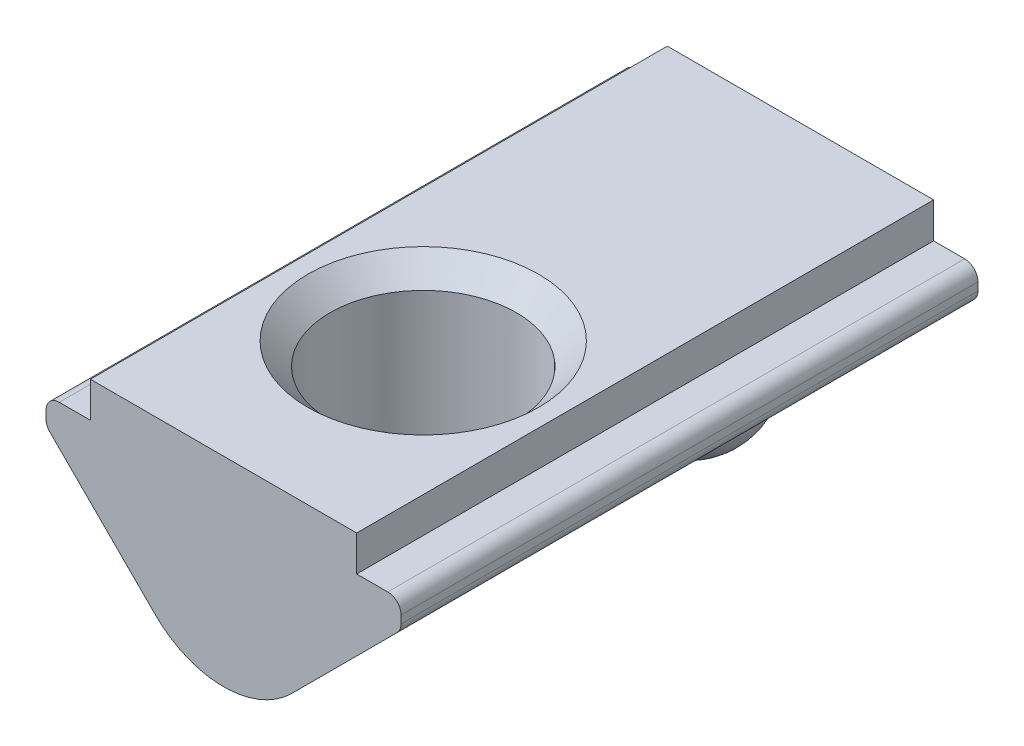
ISO-10303-21;
HEADER;
FILE_DESCRIPTION(('STEP AP214'),'2;1');
FILE_NAME('part.step','',(''),(''),'','','');
FILE_SCHEMA(('AUTOMOTIVE_DESIGN { 1 0 10303 214 1 1 1 1 }'));
ENDSEC;
DATA;
#1=APPLICATION_CONTEXT('core data for automotive mechanical design processes');
#2=APPLICATION_PROTOCOL_DEFINITION('international standard','automotive_design',2000,#1);
#3=PRODUCT_CONTEXT('',#1,'mechanical');
#4=PRODUCT('Part','Part','',(#3));
#5=PRODUCT_RELATED_PRODUCT_CATEGORY('part','',(#4));
#6=PRODUCT_DEFINITION_FORMATION('','',#4);
#7=PRODUCT_DEFINITION_CONTEXT('part definition',#1,'design');
#8=PRODUCT_DEFINITION('design','',#6,#7);
#9=PRODUCT_DEFINITION_SHAPE('','',#8);
#10=(LENGTH_UNIT() NAMED_UNIT(*) SI_UNIT(.MILLI.,.METRE.));
#11=(NAMED_UNIT(*) PLANE_ANGLE_UNIT() SI_UNIT($,.RADIAN.));
#12=(NAMED_UNIT(*) SI_UNIT($,.STERADIAN.) SOLID_ANGLE_UNIT());
#13=UNCERTAINTY_MEASURE_WITH_UNIT(LENGTH_MEASURE(1.E-05),#10,'distance_accuracy_value','');
#14=(GEOMETRIC_REPRESENTATION_CONTEXT(3) GLOBAL_UNCERTAINTY_ASSIGNED_CONTEXT((#13)) GLOBAL_UNIT_ASSIGNED_CONTEXT((#10,
#11,#12)) REPRESENTATION_CONTEXT('',''));
#15=CARTESIAN_POINT('',(0.,0.,0.));
#16=DIRECTION('',(0.,0.,1.));
#17=DIRECTION('',(1.,0.,0.));
#18=AXIS2_PLACEMENT_3D('',#15,#16,#17);
#19=CARTESIAN_POINT('',(0.,-2.3272077938642,6.5));
#20=DIRECTION('',(0.,0.,-1.));
#21=DIRECTION('',(-1.,0.,0.));
#22=AXIS2_PLACEMENT_3D('',#19,#20,#21);
#23=CYLINDRICAL_SURFACE('',#22,2.1727922061358);
#24=CARTESIAN_POINT('',(0.,-4.5,-2.8819660112501));
#25=CARTESIAN_POINT('',(0.0842303309173296,-4.49999855111517,-2.88196633157336));
#26=CARTESIAN_POINT('',(0.16847119543235,-4.49507118850862,-2.88710048706043));
#27=CARTESIAN_POINT('',(0.334563064093868,-4.47571560869941,-2.90768842694785));
#28=CARTESIAN_POINT('',(0.416414003630831,-4.4612871348904,-2.9231424900688));
#29=CARTESIAN_POINT('',(0.575407421912194,-4.42401419278143,-2.96452960837165));
#30=CARTESIAN_POINT('',(0.652550469946638,-4.40117074440119,-2.99046139365961));
#31=CARTESIAN_POINT('',(0.800002481194144,-4.34887590636583,-3.05315759958394));
#32=CARTESIAN_POINT('',(0.870305106224547,-4.31941847035847,-3.0899319419261));
#33=CARTESIAN_POINT('',(1.00116691911539,-4.25694776026208,-3.17436574832074));
#34=CARTESIAN_POINT('',(1.06181492041801,-4.22397220182363,-3.22191489589671));
#35=CARTESIAN_POINT('',(1.17182208721126,-4.15803908903499,-3.32863324249409));
#36=CARTESIAN_POINT('',(1.22121213180819,-4.12508173895149,-3.3877698084312));
#37=CARTESIAN_POINT('',(1.29003653326974,-4.07589491550365,-3.49318898289668));
#38=CARTESIAN_POINT('',(1.31374927827934,-4.05803780858356,-3.53593371820567));
#39=CARTESIAN_POINT('',(1.35494043677892,-4.0259840392101,-3.62562018448564));
#40=CARTESIAN_POINT('',(1.37242493804386,-4.01178380614159,-3.67255776072359));
#41=CARTESIAN_POINT('',(1.40045312716439,-3.98856233894596,-3.77025727943218));
#42=CARTESIAN_POINT('',(1.41092788072989,-3.97959264969888,-3.82105188720173));
#43=CARTESIAN_POINT('',(1.42394755705963,-3.96839017175623,-3.9243703584753));
#44=CARTESIAN_POINT('',(1.42650051336135,-3.96615055812741,-3.97689241548578));
#45=CARTESIAN_POINT('',(1.42372574834378,-3.96855713450931,-4.0739698188989));
#46=CARTESIAN_POINT('',(1.41947697116526,-3.97226077313887,-4.11858620613709));
#47=CARTESIAN_POINT('',(1.40528823238396,-3.98439729940903,-4.20623201513968));
#48=CARTESIAN_POINT('',(1.39534706719625,-3.99283118719448,-4.24926109923983));
#49=CARTESIAN_POINT('',(1.37018056785478,-4.01359286620544,-4.33294811804719));
#50=CARTESIAN_POINT('',(1.35493115899743,-4.02593837466991,-4.37359424675713));
#51=CARTESIAN_POINT('',(1.3197164608509,-4.05343910991889,-4.45175680581398));
#52=CARTESIAN_POINT('',(1.29974826616946,-4.0685960664918,-4.48927128864845));
#53=CARTESIAN_POINT('',(1.24459149962959,-4.10868998559647,-4.57882667993944));
#54=CARTESIAN_POINT('',(1.20678188896966,-4.13473099777314,-4.62876623852903));
#55=CARTESIAN_POINT('',(1.12328417546792,-4.18777619812761,-4.72096221660325));
#56=CARTESIAN_POINT('',(1.0775825044373,-4.21478198047074,-4.76320514251109));
#57=CARTESIAN_POINT('',(0.978753321303708,-4.26789532034229,-4.84089967514649));
#58=CARTESIAN_POINT('',(0.925509924549038,-4.29397891100982,-4.87621959826439));
#59=CARTESIAN_POINT('',(0.813471166476377,-4.34290433495116,-4.93942299137123));
#60=CARTESIAN_POINT('',(0.754677240720898,-4.36574700263737,-4.96730837709757));
#61=CARTESIAN_POINT('',(0.621943788707839,-4.41045739012713,-5.02019168950936));
#62=CARTESIAN_POINT('',(0.547158068491612,-4.43144882560476,-5.0438217054878));
#63=CARTESIAN_POINT('',(0.393446841529932,-4.46553276604001,-5.0814366908944));
#64=CARTESIAN_POINT('',(0.314519071093556,-4.47862090182166,-5.09541632591912));
#65=CARTESIAN_POINT('',(0.151400289992606,-4.49633087176125,-5.11422047718119));
#66=CARTESIAN_POINT('',(0.0671249533959798,-4.50059384801617,-5.11865721517349));
#67=CARTESIAN_POINT('',(-0.101254328687025,-4.4992721271511,-5.11727016892315));
#68=CARTESIAN_POINT('',(-0.185358284529483,-4.49368804386192,-5.11144702424526));
#69=CARTESIAN_POINT('',(-0.35113174844667,-4.4730682467818,-5.08947281741961));
#70=CARTESIAN_POINT('',(-0.432797988744982,-4.45802039460013,-5.07330849103682));
#71=CARTESIAN_POINT('',(-0.59130689253848,-4.41958274227056,-5.03045377036557));
#72=CARTESIAN_POINT('',(-0.668147475527518,-4.39618937272923,-5.00375887161402));
#73=CARTESIAN_POINT('',(-0.814718890163093,-4.34297972355502,-4.93953683249765));
#74=CARTESIAN_POINT('',(-0.884452670817997,-4.31316612415247,-4.90201421012796));
#75=CARTESIAN_POINT('',(-1.01464568029042,-4.24989748771758,-4.81561719161915));
#76=CARTESIAN_POINT('',(-1.07511394519103,-4.21644605359357,-4.76675397375317));
#77=CARTESIAN_POINT('',(-1.16928055316175,-4.15913814452597,-4.67234133882737));
#78=CARTESIAN_POINT('',(-1.20575807813653,-4.13518578907621,-4.6296105287969));
#79=CARTESIAN_POINT('',(-1.27154321895058,-4.08953541447432,-4.53788092869314));
#80=CARTESIAN_POINT('',(-1.30086271786266,-4.06783369397031,-4.48889273537551));
#81=CARTESIAN_POINT('',(-1.34593786475505,-4.03311484221702,-4.39570462054));
#82=CARTESIAN_POINT('',(-1.36324195092989,-4.01922938507074,-4.35258183902105));
#83=CARTESIAN_POINT('',(-1.39184227970683,-3.9957835846973,-4.26325869347268));
#84=CARTESIAN_POINT('',(-1.40314330241723,-3.98621980112478,-4.21706081116725));
#85=CARTESIAN_POINT('',(-1.4191946126179,-3.97251305993219,-4.12240949520959));
#86=CARTESIAN_POINT('',(-1.42390185058917,-3.96840573535232,-4.0739433542438));
#87=CARTESIAN_POINT('',(-1.42631627340881,-3.96630869989105,-3.97670811204484));
#88=CARTESIAN_POINT('',(-1.42402551773873,-3.96831718914949,-3.92793910415993));
#89=CARTESIAN_POINT('',(-1.41319292873848,-3.97764775845865,-3.83676111482451));
#90=CARTESIAN_POINT('',(-1.40531306689323,-3.98440650566728,-3.79421108606796));
#91=CARTESIAN_POINT('',(-1.38442633240564,-4.00189412926015,-3.71125363318761));
#92=CARTESIAN_POINT('',(-1.37141722395496,-4.01262473682984,-3.67084715214947));
#93=CARTESIAN_POINT('',(-1.33567747186543,-4.04117041666565,-3.57991300821325));
#94=CARTESIAN_POINT('',(-1.31115458891478,-4.06015479502001,-3.53045776082309));
#95=CARTESIAN_POINT('',(-1.25504465797441,-4.10121464460792,-3.4371457552608));
#96=CARTESIAN_POINT('',(-1.22344388269068,-4.12329609094912,-3.39330013994697));
#97=CARTESIAN_POINT('',(-1.14450321349988,-4.17488927914732,-3.29987057606816));
#98=CARTESIAN_POINT('',(-1.09523337930063,-4.20475155208763,-3.25211268447254));
#99=CARTESIAN_POINT('',(-0.988587325079709,-4.26303461411386,-3.16570684057961));
#100=CARTESIAN_POINT('',(-0.931206372423186,-4.29145454838024,-3.12706424220901));
#101=CARTESIAN_POINT('',(-0.8090743005586,-4.34486106466388,-3.05802658700122));
#102=CARTESIAN_POINT('',(-0.744235105523627,-4.36979681047844,-3.02774837988607));
#103=CARTESIAN_POINT('',(-0.609408359556503,-4.41399563728596,-2.9758213360058));
#104=CARTESIAN_POINT('',(-0.539421907015559,-4.4332599241669,-2.95417066447338));
#105=CARTESIAN_POINT('',(-0.392349601983774,-4.46567193528795,-2.91841938093128));
#106=CARTESIAN_POINT('',(-0.315083894665737,-4.47847295264263,-2.90474160136218));
#107=CARTESIAN_POINT('',(-0.158548954341807,-4.49563889887239,-2.88651343280822));
#108=CARTESIAN_POINT('',(-0.0792791429869385,-4.50000136371716,-2.88196570975594));
#109=CARTESIAN_POINT('',(0.,-4.5,-2.8819660112501));
#110=B_SPLINE_CURVE_WITH_KNOTS('',3,(#24,#25,#26,#27,#28,#29,#30,#31,#32,#33,#34,#35,#36,#37,
#38,#39,#40,#41,#42,#43,#44,#45,#46,#47,#48,#49,#50,#51,#52,#53,#54,#55,#56,#57,#58,#59,#60,#61,
#62,#63,#64,#65,#66,#67,#68,#69,#70,#71,#72,#73,#74,#75,#76,#77,#78,#79,#80,#81,#82,#83,#84,#85,
#86,#87,#88,#89,#90,#91,#92,#93,#94,#95,#96,#97,#98,#99,#100,#101,#102,#103,#104,#105,#106,#107,
#108,#109),.UNSPECIFIED.,.T.,.F.,(4,2,2,2,2,2,2,2,2,2,2,2,2,2,2,2,2,2,2,2,2,2,2,2,2,2,2,2,2,2,2,
2,2,2,2,2,2,2,2,2,2,2,4),(0.,0.252411735178092,0.504830287780983,0.757218256572261,
1.0098378987951,1.25997946392424,1.50942643822576,1.66499879554141,1.8204186692244,
1.97734533181334,2.1341128021284,2.26837014720749,2.40265588982667,2.53755877486978,
2.67254493805455,2.87494155135125,3.07768965770269,3.2839833704589,3.49022387379938,
3.73269674695461,3.97530354380059,4.22759586219719,4.4798724541404,4.7324732820823,
4.98518227765419,5.23778597952022,5.49014174289248,5.67272997324359,5.85501299481085,
5.99992791480923,6.14472726858611,6.29046765108396,6.43616514690186,6.56699003630751,
6.69787201466712,6.87204089572346,7.04655054134616,7.26987921484621,7.49333873707935,
7.71977802563765,7.9461691329506,8.18367437921688,8.42124896579195),.UNSPECIFIED.);
#111=CARTESIAN_POINT('',(0.,-4.5,-2.8819660112501));
#112=VERTEX_POINT('',#111);
#113=EDGE_CURVE('E244',#112,#112,#110,.T.);
#114=ORIENTED_EDGE('',*,*,#113,.T.);
#115=EDGE_LOOP('',(#114));
#116=FACE_BOUND('',#115,.T.);
#117=DIRECTION('',(0.,0.,-1.));
#118=VECTOR('',#117,1.);
#119=CARTESIAN_POINT('',(1.53639610306791,-3.8636038969321,6.5));
#120=LINE('',#119,#118);
#121=CARTESIAN_POINT('',(1.53639610306791,-3.8636038969321,0.568397047195788));
#122=VERTEX_POINT('',#121);
#123=CARTESIAN_POINT('',(1.53639610306791,-3.8636038969321,-6.5));
#124=VERTEX_POINT('',#123);
#125=EDGE_CURVE('E247',#122,#124,#120,.T.);
#126=ORIENTED_EDGE('',*,*,#125,.F.);
#127=CARTESIAN_POINT('',(1.53639610306791,-3.8636038969321,0.568397047195787));
#128=CARTESIAN_POINT('',(1.46613587375251,-3.9338978328833,0.493007522689332));
#129=CARTESIAN_POINT('',(1.38867800777796,-4.00165913458617,0.421017709796726));
#130=CARTESIAN_POINT('',(1.21874752388419,-4.12916793499698,0.286364229323557));
#131=CARTESIAN_POINT('',(1.12614193921448,-4.18883502492429,0.223793543991475));
#132=CARTESIAN_POINT('',(0.947688183957498,-4.28446917854302,0.123834006766832));
#133=CARTESIAN_POINT('',(0.864546403104193,-4.32278007847992,0.0839178546955437));
#134=CARTESIAN_POINT('',(0.690523750559167,-4.38945030034151,0.0145751321477001));
#135=CARTESIAN_POINT('',(0.599669325459111,-4.4178420478166,-0.0148856219484725));
#136=CARTESIAN_POINT('',(0.411090051250498,-4.46297506830245,-0.0616773894155721));
#137=CARTESIAN_POINT('',(0.313309780052928,-4.47960697832508,-0.0788945492679103));
#138=CARTESIAN_POINT('',(0.114883151271506,-4.49924553255216,-0.0992211525319119));
#139=CARTESIAN_POINT('',(0.0142368063091426,-4.50225223674934,-0.102330658060577));
#140=CARTESIAN_POINT('',(-0.172669817621513,-4.49487784371195,-0.0946998986578695));
#141=CARTESIAN_POINT('',(-0.259080978065078,-4.48620575452672,-0.0857276304671786));
#142=CARTESIAN_POINT('',(-0.428558416134259,-4.45904377900319,-0.0575985775867776));
#143=CARTESIAN_POINT('',(-0.511626398629306,-4.44055896674459,-0.0384470565000265));
#144=CARTESIAN_POINT('',(-0.673735919596493,-4.39464861560955,0.0091893279435033));
#145=CARTESIAN_POINT('',(-0.752704812076104,-4.36710153694084,0.0378010967101359));
#146=CARTESIAN_POINT('',(-0.904360335876589,-4.30455676826254,0.102906849641179));
#147=CARTESIAN_POINT('',(-0.977030956627136,-4.26954083058454,0.139420141781911));
#148=CARTESIAN_POINT('',(-1.14156741807881,-4.17915250884564,0.23394693381033));
#149=CARTESIAN_POINT('',(-1.23026535448202,-4.12109551667968,0.294863446922535));
#150=CARTESIAN_POINT('',(-1.39362635716822,-3.99732014053316,0.425625448503492));
#151=CARTESIAN_POINT('',(-1.4683771108253,-3.93165414456603,0.495410167759385));
#152=CARTESIAN_POINT('',(-1.53639610306791,-3.8636038969321,0.568397047195786));
#153=B_SPLINE_CURVE_WITH_KNOTS('',3,(#127,#128,#129,#130,#131,#132,#133,#134,#135,#136,#137,
#138,#139,#140,#141,#142,#143,#144,#145,#146,#147,#148,#149,#150,#151,#152),.UNSPECIFIED.,.F.,
.F.,(4,2,2,2,2,2,2,2,2,2,2,2,4),(0.,0.37487555133975,0.753238243125928,1.05165750379393,
1.34909190248225,1.64925721304226,1.94942120195184,2.21010159676562,2.47064732697058,
2.73484046982616,2.99968662919478,3.36494203369763,3.72781737385821),.UNSPECIFIED.);
#154=CARTESIAN_POINT('',(-1.53639610306791,-3.8636038969321,0.568397047195787));
#155=VERTEX_POINT('',#154);
#156=EDGE_CURVE('E161',#122,#155,#153,.T.);
#157=ORIENTED_EDGE('',*,*,#156,.T.);
#158=DIRECTION('',(0.,0.,-1.));
#159=VECTOR('',#158,1.);
#160=CARTESIAN_POINT('',(-1.53639610306791,-3.8636038969321,6.5));
#161=LINE('',#160,#159);
#162=CARTESIAN_POINT('',(-1.53639610306791,-3.8636038969321,-6.5));
#163=VERTEX_POINT('',#162);
#164=EDGE_CURVE('E171',#155,#163,#161,.T.);
#165=ORIENTED_EDGE('',*,*,#164,.T.);
#166=CARTESIAN_POINT('',(0.,-2.3272077938642,-6.5));
#167=DIRECTION('',(0.,0.,1.));
#168=DIRECTION('',(-1.,0.,0.));
#169=AXIS2_PLACEMENT_3D('',#166,#167,#168);
#170=CIRCLE('',#169,2.1727922061358);
#171=EDGE_CURVE('E249',#163,#124,#170,.T.);
#172=ORIENTED_EDGE('',*,*,#171,.T.);
#173=EDGE_LOOP('',(#126,#157,#165,#172));
#174=FACE_BOUND('',#173,.T.);
#175=ADVANCED_FACE('F37',(#116,#174),#23,.T.);
#176=CARTESIAN_POINT('',(3.,0.,6.5));
#177=DIRECTION('',(-1.,0.,0.));
#178=DIRECTION('',(0.,0.,1.));
#179=AXIS2_PLACEMENT_3D('',#176,#177,#178);
#180=PLANE('',#179);
#181=DIRECTION('',(0.,1.,0.));
#182=VECTOR('',#181,1.);
#183=CARTESIAN_POINT('',(3.,0.,-6.5));
#184=LINE('',#183,#182);
#185=CARTESIAN_POINT('',(3.,-0.8,-6.5));
#186=VERTEX_POINT('',#185);
#187=CARTESIAN_POINT('',(3.,0.,-6.5));
#188=VERTEX_POINT('',#187);
#189=EDGE_CURVE('E172',#186,#188,#184,.T.);
#190=ORIENTED_EDGE('',*,*,#189,.T.);
#191=DIRECTION('',(0.,0.,-1.));
#192=VECTOR('',#191,1.);
#193=CARTESIAN_POINT('',(3.,0.,6.5));
#194=LINE('',#193,#192);
#195=CARTESIAN_POINT('',(3.,0.,6.5));
#196=VERTEX_POINT('',#195);
#197=EDGE_CURVE('E162',#196,#188,#194,.T.);
#198=ORIENTED_EDGE('',*,*,#197,.F.);
#199=DIRECTION('',(0.,1.,0.));
#200=VECTOR('',#199,1.);
#201=CARTESIAN_POINT('',(3.,0.,6.5));
#202=LINE('',#201,#200);
#203=CARTESIAN_POINT('',(3.,-0.8,6.5));
#204=VERTEX_POINT('',#203);
#205=EDGE_CURVE('E263',#204,#196,#202,.T.);
#206=ORIENTED_EDGE('',*,*,#205,.F.);
#207=DIRECTION('',(0.,0.,-1.));
#208=VECTOR('',#207,1.);
#209=CARTESIAN_POINT('',(3.,-0.8,6.5));
#210=LINE('',#209,#208);
#211=EDGE_CURVE('E251',#204,#186,#210,.T.);
#212=ORIENTED_EDGE('',*,*,#211,.T.);
#213=EDGE_LOOP('',(#190,#198,#206,#212));
#214=FACE_BOUND('',#213,.T.);
#215=ADVANCED_FACE('F233',(#214),#180,.F.);
#216=CARTESIAN_POINT('',(-3.,0.,6.5));
#217=DIRECTION('',(0.,-1.,0.));
#218=DIRECTION('',(0.,0.,-1.));
#219=AXIS2_PLACEMENT_3D('',#216,#217,#218);
#220=PLANE('',#219);
#221=CARTESIAN_POINT('',(0.,0.,2.));
#222=DIRECTION('',(0.,1.,0.));
#223=DIRECTION('',(0.,0.,1.));
#224=AXIS2_PLACEMENT_3D('',#221,#222,#223);
#225=CIRCLE('',#224,2.6);
#226=CARTESIAN_POINT('',(0.,0.,4.6));
#227=VERTEX_POINT('',#226);
#228=EDGE_CURVE('E305',#227,#227,#225,.T.);
#229=ORIENTED_EDGE('',*,*,#228,.F.);
#230=EDGE_LOOP('',(#229));
#231=FACE_BOUND('',#230,.T.);
#232=DIRECTION('',(-1.,0.,0.));
#233=VECTOR('',#232,1.);
#234=CARTESIAN_POINT('',(-3.,0.,-6.5));
#235=LINE('',#234,#233);
#236=CARTESIAN_POINT('',(-3.,0.,-6.5));
#237=VERTEX_POINT('',#236);
#238=EDGE_CURVE('E280',#188,#237,#235,.T.);
#239=ORIENTED_EDGE('',*,*,#238,.T.);
#240=DIRECTION('',(0.,0.,-1.));
#241=VECTOR('',#240,1.);
#242=CARTESIAN_POINT('',(-3.,0.,6.5));
#243=LINE('',#242,#241);
#244=CARTESIAN_POINT('',(-3.,0.,6.5));
#245=VERTEX_POINT('',#244);
#246=EDGE_CURVE('E179',#245,#237,#243,.T.);
#247=ORIENTED_EDGE('',*,*,#246,.F.);
#248=DIRECTION('',(-1.,0.,0.));
#249=VECTOR('',#248,1.);
#250=CARTESIAN_POINT('',(-3.,0.,6.5));
#251=LINE('',#250,#249);
#252=EDGE_CURVE('E297',#196,#245,#251,.T.);
#253=ORIENTED_EDGE('',*,*,#252,.F.);
#254=ORIENTED_EDGE('',*,*,#197,.T.);
#255=EDGE_LOOP('',(#239,#247,#253,#254));
#256=FACE_BOUND('',#255,.T.);
#257=ADVANCED_FACE('F238',(#231,#256),#220,.F.);
#258=CARTESIAN_POINT('',(-3.,0.,6.5));
#259=DIRECTION('',(1.,0.,0.));
#260=DIRECTION('',(0.,0.,-1.));
#261=AXIS2_PLACEMENT_3D('',#258,#259,#260);
#262=PLANE('',#261);
#263=DIRECTION('',(0.,-1.,0.));
#264=VECTOR('',#263,1.);
#265=CARTESIAN_POINT('',(-3.,0.,-6.5));
#266=LINE('',#265,#264);
#267=CARTESIAN_POINT('',(-3.,-0.8,-6.5));
#268=VERTEX_POINT('',#267);
#269=EDGE_CURVE('E278',#237,#268,#266,.T.);
#270=ORIENTED_EDGE('',*,*,#269,.T.);
#271=DIRECTION('',(0.,0.,-1.));
#272=VECTOR('',#271,1.);
#273=CARTESIAN_POINT('',(-3.,-0.8,6.5));
#274=LINE('',#273,#272);
#275=CARTESIAN_POINT('',(-3.,-0.8,6.5));
#276=VERTEX_POINT('',#275);
#277=EDGE_CURVE('E176',#276,#268,#274,.T.);
#278=ORIENTED_EDGE('',*,*,#277,.F.);
#279=DIRECTION('',(0.,-1.,0.));
#280=VECTOR('',#279,1.);
#281=CARTESIAN_POINT('',(-3.,0.,6.5));
#282=LINE('',#281,#280);
#283=EDGE_CURVE('E295',#245,#276,#282,.T.);
#284=ORIENTED_EDGE('',*,*,#283,.F.);
#285=ORIENTED_EDGE('',*,*,#246,.T.);
#286=EDGE_LOOP('',(#270,#278,#284,#285));
#287=FACE_BOUND('',#286,.T.);
#288=ADVANCED_FACE('F383',(#287),#262,.F.);
#289=CARTESIAN_POINT('',(-3.,-0.8,6.5));
#290=DIRECTION('',(0.,-1.,0.));
#291=DIRECTION('',(1.,0.,0.));
#292=AXIS2_PLACEMENT_3D('',#289,#290,#291);
#293=PLANE('',#292);
#294=DIRECTION('',(-1.,0.,0.));
#295=VECTOR('',#294,1.);
#296=CARTESIAN_POINT('',(-3.,-0.8,-6.5));
#297=LINE('',#296,#295);
#298=CARTESIAN_POINT('',(-3.7,-0.8,-6.5));
#299=VERTEX_POINT('',#298);
#300=EDGE_CURVE('E275',#268,#299,#297,.T.);
#301=ORIENTED_EDGE('',*,*,#300,.T.);
#302=DIRECTION('',(0.,0.,-1.));
#303=VECTOR('',#302,1.);
#304=CARTESIAN_POINT('',(-3.7,-0.8,6.5));
#305=LINE('',#304,#303);
#306=CARTESIAN_POINT('',(-3.7,-0.8,6.5));
#307=VERTEX_POINT('',#306);
#308=EDGE_CURVE('E45',#299,#307,#305,.F.);
#309=ORIENTED_EDGE('',*,*,#308,.T.);
#310=DIRECTION('',(-1.,0.,0.));
#311=VECTOR('',#310,1.);
#312=CARTESIAN_POINT('',(-3.,-0.8,6.5));
#313=LINE('',#312,#311);
#314=EDGE_CURVE('E292',#276,#307,#313,.T.);
#315=ORIENTED_EDGE('',*,*,#314,.F.);
#316=ORIENTED_EDGE('',*,*,#277,.T.);
#317=EDGE_LOOP('',(#301,#309,#315,#316));
#318=FACE_BOUND('',#317,.T.);
#319=ADVANCED_FACE('F374',(#318),#293,.F.);
#320=CARTESIAN_POINT('',(-4.,-0.8,6.5));
#321=DIRECTION('',(1.,0.,0.));
#322=DIRECTION('',(0.,0.,-1.));
#323=AXIS2_PLACEMENT_3D('',#320,#321,#322);
#324=PLANE('',#323);
#325=DIRECTION('',(0.,-1.,0.));
#326=VECTOR('',#325,1.);
#327=CARTESIAN_POINT('',(-4.,-0.8,6.5));
#328=LINE('',#327,#326);
#329=CARTESIAN_POINT('',(-4.,-1.1,6.5));
#330=VERTEX_POINT('',#329);
#331=CARTESIAN_POINT('',(-4.,-1.27573593128807,6.5));
#332=VERTEX_POINT('',#331);
#333=EDGE_CURVE('E290',#330,#332,#328,.T.);
#334=ORIENTED_EDGE('',*,*,#333,.F.);
#335=DIRECTION('',(0.,0.,-1.));
#336=VECTOR('',#335,1.);
#337=CARTESIAN_POINT('',(-4.,-1.1,6.5));
#338=LINE('',#337,#336);
#339=CARTESIAN_POINT('',(-4.,-1.1,-6.5));
#340=VERTEX_POINT('',#339);
#341=EDGE_CURVE('E450',#330,#340,#338,.T.);
#342=ORIENTED_EDGE('',*,*,#341,.T.);
#343=DIRECTION('',(0.,-1.,0.));
#344=VECTOR('',#343,1.);
#345=CARTESIAN_POINT('',(-4.,-0.8,-6.5));
#346=LINE('',#345,#344);
#347=CARTESIAN_POINT('',(-4.,-1.27573593128807,-6.5));
#348=VERTEX_POINT('',#347);
#349=EDGE_CURVE('E272',#340,#348,#346,.T.);
#350=ORIENTED_EDGE('',*,*,#349,.T.);
#351=DIRECTION('',(0.,0.,-1.));
#352=VECTOR('',#351,1.);
#353=CARTESIAN_POINT('',(-4.,-1.27573593128807,6.5));
#354=LINE('',#353,#352);
#355=EDGE_CURVE('E463',#348,#332,#354,.F.);
#356=ORIENTED_EDGE('',*,*,#355,.T.);
#357=EDGE_LOOP('',(#334,#342,#350,#356));
#358=FACE_BOUND('',#357,.T.);
#359=ADVANCED_FACE('F366',(#358),#324,.F.);
#360=CARTESIAN_POINT('',(-1.53639610306791,-3.8636038969321,6.5));
#361=DIRECTION('',(0.707106781186548,0.707106781186547,0.));
#362=DIRECTION('',(-0.707106781186547,0.707106781186548,0.));
#363=AXIS2_PLACEMENT_3D('',#360,#361,#362);
#364=PLANE('',#363);
#365=DIRECTION('',(0.707106781186547,-0.707106781186548,0.));
#366=VECTOR('',#365,1.);
#367=CARTESIAN_POINT('',(-1.53639610306791,-3.8636038969321,6.5));
#368=LINE('',#367,#366);
#369=CARTESIAN_POINT('',(-3.91213203435596,-1.48786796564404,6.5));
#370=VERTEX_POINT('',#369);
#371=CARTESIAN_POINT('',(-1.53639610306791,-3.8636038969321,6.5));
#372=VERTEX_POINT('',#371);
#373=EDGE_CURVE('E288',#370,#372,#368,.T.);
#374=ORIENTED_EDGE('',*,*,#373,.F.);
#375=DIRECTION('',(0.,0.,-1.));
#376=VECTOR('',#375,1.);
#377=CARTESIAN_POINT('',(-3.91213203435596,-1.48786796564404,6.5));
#378=LINE('',#377,#376);
#379=CARTESIAN_POINT('',(-3.91213203435596,-1.48786796564404,-6.5));
#380=VERTEX_POINT('',#379);
#381=EDGE_CURVE('E11',#370,#380,#378,.T.);
#382=ORIENTED_EDGE('',*,*,#381,.T.);
#383=DIRECTION('',(0.707106781186547,-0.707106781186548,0.));
#384=VECTOR('',#383,1.);
#385=CARTESIAN_POINT('',(-1.53639610306791,-3.8636038969321,-6.5));
#386=LINE('',#385,#384);
#387=EDGE_CURVE('E270',#380,#163,#386,.T.);
#388=ORIENTED_EDGE('',*,*,#387,.T.);
#389=ORIENTED_EDGE('',*,*,#164,.F.);
#390=CARTESIAN_POINT('',(0.,-5.40000000000001,2.));
#391=DIRECTION('',(0.707106781186548,0.707106781186547,0.));
#392=DIRECTION('',(-0.707106781186547,0.707106781186548,0.));
#393=AXIS2_PLACEMENT_3D('',#390,#391,#392);
#394=ELLIPSE('',#393,2.9698484809835,2.1);
#395=CARTESIAN_POINT('',(-1.53639610306791,-3.8636038969321,3.43160295280422));
#396=VERTEX_POINT('',#395);
#397=EDGE_CURVE('E153',#155,#396,#394,.T.);
#398=ORIENTED_EDGE('',*,*,#397,.T.);
#399=EDGE_CURVE('E168',#372,#396,#161,.T.);
#400=ORIENTED_EDGE('',*,*,#399,.F.);
#401=EDGE_LOOP('',(#374,#382,#388,#389,#398,#400));
#402=FACE_BOUND('',#401,.T.);
#403=ADVANCED_FACE('F167',(#402),#364,.F.);
#404=ORIENTED_EDGE('',*,*,#399,.T.);
#405=CARTESIAN_POINT('',(-1.53639610306791,-3.8636038969321,3.43160295280422));
#406=CARTESIAN_POINT('',(-1.46615001369697,-3.93388579631887,3.50697956872249));
#407=CARTESIAN_POINT('',(-1.38870534468911,-4.00163613975528,3.57895786409693));
#408=CARTESIAN_POINT('',(-1.21877742628574,-4.1291479996101,3.71361487481121));
#409=CARTESIAN_POINT('',(-1.12615638240135,-4.18882619435878,3.77619723791848));
#410=CARTESIAN_POINT('',(-0.947663459049502,-4.28448328888605,3.87618073240285));
#411=CARTESIAN_POINT('',(-0.864496075969729,-4.32280557660245,3.91610868335927));
#412=CARTESIAN_POINT('',(-0.69045637267669,-4.38946992297878,3.98544525801234));
#413=CARTESIAN_POINT('',(-0.599615969536779,-4.41785101960396,4.01489503569981));
#414=CARTESIAN_POINT('',(-0.424618326690317,-4.45974060885315,4.05832395866861));
#415=CARTESIAN_POINT('',(-0.341204831537578,-4.47473576188984,4.0738508543038));
#416=CARTESIAN_POINT('',(-0.171867299742489,-4.49486937784194,4.09469289450895));
#417=CARTESIAN_POINT('',(-0.0859419701245585,-4.50000267028731,4.1000026823588));
#418=CARTESIAN_POINT('',(0.0949556963847467,-4.49999704964884,4.09999703631127));
#419=CARTESIAN_POINT('',(0.18993170688794,-4.49372430489658,4.09350880438678));
#420=CARTESIAN_POINT('',(0.376550007661134,-4.46919477650357,4.06811329166899));
#421=CARTESIAN_POINT('',(0.468192301837336,-4.45093800690531,4.04920602542789));
#422=CARTESIAN_POINT('',(0.644937920061929,-4.40407816506341,4.00060154739426));
#423=CARTESIAN_POINT('',(0.730083783129199,-4.37555095813503,3.9709834470364));
#424=CARTESIAN_POINT('',(0.893264464767707,-4.30985017382978,3.90261185429579));
#425=CARTESIAN_POINT('',(0.971279228962007,-4.27265319702835,3.86383363516638));
#426=CARTESIAN_POINT('',(1.14091272932417,-4.17957275152246,3.76649402345834));
#427=CARTESIAN_POINT('',(1.22983325670392,-4.12140617897452,3.70546401828784));
#428=CARTESIAN_POINT('',(1.39347632786529,-3.99745038034009,3.57451280360195));
#429=CARTESIAN_POINT('',(1.46830355394868,-3.93172371594665,3.50466415787785));
#430=CARTESIAN_POINT('',(1.53639610306791,-3.8636038969321,3.43160295280421));
#431=B_SPLINE_CURVE_WITH_KNOTS('',3,(#405,#406,#407,#408,#409,#410,#411,#412,#413,#414,#415,
#416,#417,#418,#419,#420,#421,#422,#423,#424,#425,#426,#427,#428,#429,#430),.UNSPECIFIED.,.F.,
.F.,(4,2,2,2,2,2,2,2,2,2,2,2,4),(0.,0.374812235068192,0.753238199003681,1.05175793091317,
1.34909190857538,1.60644611826587,1.8639352192855,2.14843017400163,2.43292479535692,
2.71535964594455,2.99856579128375,3.36463377494207,3.72786505388237),.UNSPECIFIED.);
#432=CARTESIAN_POINT('',(1.53639610306791,-3.8636038969321,3.43160295280422));
#433=VERTEX_POINT('',#432);
#434=EDGE_CURVE('E150',#396,#433,#431,.T.);
#435=ORIENTED_EDGE('',*,*,#434,.T.);
#436=CARTESIAN_POINT('',(1.53639610306791,-3.8636038969321,6.5));
#437=VERTEX_POINT('',#436);
#438=EDGE_CURVE('E181',#437,#433,#120,.T.);
#439=ORIENTED_EDGE('',*,*,#438,.F.);
#440=CARTESIAN_POINT('',(0.,-2.3272077938642,6.5));
#441=DIRECTION('',(0.,0.,1.));
#442=DIRECTION('',(-1.,0.,0.));
#443=AXIS2_PLACEMENT_3D('',#440,#441,#442);
#444=CIRCLE('',#443,2.1727922061358);
#445=EDGE_CURVE('E175',#372,#437,#444,.T.);
#446=ORIENTED_EDGE('',*,*,#445,.F.);
#447=EDGE_LOOP('',(#404,#435,#439,#446));
#448=FACE_BOUND('',#447,.T.);
#449=ADVANCED_FACE('F174',(#448),#23,.T.);
#450=CARTESIAN_POINT('',(4.,-1.4,6.5));
#451=DIRECTION('',(-0.707106781186548,0.707106781186547,0.));
#452=DIRECTION('',(-0.707106781186547,-0.707106781186548,0.));
#453=AXIS2_PLACEMENT_3D('',#450,#451,#452);
#454=PLANE('',#453);
#455=DIRECTION('',(0.707106781186547,0.707106781186548,0.));
#456=VECTOR('',#455,1.);
#457=CARTESIAN_POINT('',(4.,-1.4,-6.5));
#458=LINE('',#457,#456);
#459=CARTESIAN_POINT('',(3.91213203435596,-1.48786796564404,-6.5));
#460=VERTEX_POINT('',#459);
#461=EDGE_CURVE('E267',#124,#460,#458,.T.);
#462=ORIENTED_EDGE('',*,*,#461,.T.);
#463=DIRECTION('',(0.,0.,-1.));
#464=VECTOR('',#463,1.);
#465=CARTESIAN_POINT('',(3.91213203435596,-1.48786796564404,6.5));
#466=LINE('',#465,#464);
#467=CARTESIAN_POINT('',(3.91213203435596,-1.48786796564404,6.5));
#468=VERTEX_POINT('',#467);
#469=EDGE_CURVE('E455',#460,#468,#466,.F.);
#470=ORIENTED_EDGE('',*,*,#469,.T.);
#471=DIRECTION('',(0.707106781186547,0.707106781186548,0.));
#472=VECTOR('',#471,1.);
#473=CARTESIAN_POINT('',(4.,-1.4,6.5));
#474=LINE('',#473,#472);
#475=EDGE_CURVE('E284',#437,#468,#474,.T.);
#476=ORIENTED_EDGE('',*,*,#475,.F.);
#477=ORIENTED_EDGE('',*,*,#438,.T.);
#478=CARTESIAN_POINT('',(0.,-5.40000000000001,2.));
#479=DIRECTION('',(-0.707106781186548,0.707106781186547,0.));
#480=DIRECTION('',(0.707106781186547,0.707106781186548,0.));
#481=AXIS2_PLACEMENT_3D('',#478,#479,#480);
#482=ELLIPSE('',#481,2.9698484809835,2.1);
#483=EDGE_CURVE('E156',#433,#122,#482,.T.);
#484=ORIENTED_EDGE('',*,*,#483,.T.);
#485=ORIENTED_EDGE('',*,*,#125,.T.);
#486=EDGE_LOOP('',(#462,#470,#476,#477,#484,#485));
#487=FACE_BOUND('',#486,.T.);
#488=ADVANCED_FACE('F224',(#487),#454,.F.);
#489=CARTESIAN_POINT('',(4.,-0.8,6.5));
#490=DIRECTION('',(-1.,0.,0.));
#491=DIRECTION('',(0.,0.,1.));
#492=AXIS2_PLACEMENT_3D('',#489,#490,#491);
#493=PLANE('',#492);
#494=DIRECTION('',(0.,1.,0.));
#495=VECTOR('',#494,1.);
#496=CARTESIAN_POINT('',(4.,-0.8,6.5));
#497=LINE('',#496,#495);
#498=CARTESIAN_POINT('',(4.,-1.27573593128807,6.5));
#499=VERTEX_POINT('',#498);
#500=CARTESIAN_POINT('',(4.,-1.1,6.5));
#501=VERTEX_POINT('',#500);
#502=EDGE_CURVE('E258',#499,#501,#497,.T.);
#503=ORIENTED_EDGE('',*,*,#502,.F.);
#504=DIRECTION('',(0.,0.,-1.));
#505=VECTOR('',#504,1.);
#506=CARTESIAN_POINT('',(4.,-1.27573593128807,6.5));
#507=LINE('',#506,#505);
#508=CARTESIAN_POINT('',(4.,-1.27573593128807,-6.5));
#509=VERTEX_POINT('',#508);
#510=EDGE_CURVE('E479',#499,#509,#507,.T.);
#511=ORIENTED_EDGE('',*,*,#510,.T.);
#512=DIRECTION('',(0.,1.,0.));
#513=VECTOR('',#512,1.);
#514=CARTESIAN_POINT('',(4.,-0.8,-6.5));
#515=LINE('',#514,#513);
#516=CARTESIAN_POINT('',(4.,-1.1,-6.5));
#517=VERTEX_POINT('',#516);
#518=EDGE_CURVE('E264',#509,#517,#515,.T.);
#519=ORIENTED_EDGE('',*,*,#518,.T.);
#520=DIRECTION('',(0.,0.,-1.));
#521=VECTOR('',#520,1.);
#522=CARTESIAN_POINT('',(4.,-1.1,6.5));
#523=LINE('',#522,#521);
#524=EDGE_CURVE('E313',#517,#501,#523,.F.);
#525=ORIENTED_EDGE('',*,*,#524,.T.);
#526=EDGE_LOOP('',(#503,#511,#519,#525));
#527=FACE_BOUND('',#526,.T.);
#528=ADVANCED_FACE('F221',(#527),#493,.F.);
#529=CARTESIAN_POINT('',(3.,-0.8,6.5));
#530=DIRECTION('',(0.,-1.,0.));
#531=DIRECTION('',(1.,0.,0.));
#532=AXIS2_PLACEMENT_3D('',#529,#530,#531);
#533=PLANE('',#532);
#534=DIRECTION('',(-1.,0.,0.));
#535=VECTOR('',#534,1.);
#536=CARTESIAN_POINT('',(3.,-0.8,6.5));
#537=LINE('',#536,#535);
#538=CARTESIAN_POINT('',(3.7,-0.8,6.5));
#539=VERTEX_POINT('',#538);
#540=EDGE_CURVE('E253',#539,#204,#537,.T.);
#541=ORIENTED_EDGE('',*,*,#540,.F.);
#542=DIRECTION('',(0.,0.,-1.));
#543=VECTOR('',#542,1.);
#544=CARTESIAN_POINT('',(3.7,-0.8,6.5));
#545=LINE('',#544,#543);
#546=CARTESIAN_POINT('',(3.7,-0.8,-6.5));
#547=VERTEX_POINT('',#546);
#548=EDGE_CURVE('E460',#539,#547,#545,.T.);
#549=ORIENTED_EDGE('',*,*,#548,.T.);
#550=DIRECTION('',(-1.,0.,0.));
#551=VECTOR('',#550,1.);
#552=CARTESIAN_POINT('',(3.,-0.8,-6.5));
#553=LINE('',#552,#551);
#554=EDGE_CURVE('E261',#547,#186,#553,.T.);
#555=ORIENTED_EDGE('',*,*,#554,.T.);
#556=ORIENTED_EDGE('',*,*,#211,.F.);
#557=EDGE_LOOP('',(#541,#549,#555,#556));
#558=FACE_BOUND('',#557,.T.);
#559=ADVANCED_FACE('F215',(#558),#533,.F.);
#560=CARTESIAN_POINT('',(0.,-2.3272077938642,6.5));
#561=DIRECTION('',(0.,0.,-1.));
#562=DIRECTION('',(-1.,0.,0.));
#563=AXIS2_PLACEMENT_3D('',#560,#561,#562);
#564=PLANE('',#563);
#565=ORIENTED_EDGE('',*,*,#475,.T.);
#566=CARTESIAN_POINT('',(3.7,-1.27573593128807,6.5));
#567=DIRECTION('',(0.,0.,-1.));
#568=DIRECTION('',(-1.,0.,0.));
#569=AXIS2_PLACEMENT_3D('',#566,#567,#568);
#570=CIRCLE('',#569,0.3);
#571=EDGE_CURVE('E453',#468,#499,#570,.F.);
#572=ORIENTED_EDGE('',*,*,#571,.T.);
#573=ORIENTED_EDGE('',*,*,#502,.T.);
#574=CARTESIAN_POINT('',(3.7,-1.1,6.5));
#575=DIRECTION('',(0.,0.,-1.));
#576=DIRECTION('',(-1.,0.,0.));
#577=AXIS2_PLACEMENT_3D('',#574,#575,#576);
#578=CIRCLE('',#577,0.3);
#579=EDGE_CURVE('E52',#501,#539,#578,.F.);
#580=ORIENTED_EDGE('',*,*,#579,.T.);
#581=ORIENTED_EDGE('',*,*,#540,.T.);
#582=ORIENTED_EDGE('',*,*,#205,.T.);
#583=ORIENTED_EDGE('',*,*,#252,.T.);
#584=ORIENTED_EDGE('',*,*,#283,.T.);
#585=ORIENTED_EDGE('',*,*,#314,.T.);
#586=CARTESIAN_POINT('',(-3.7,-1.1,6.5));
#587=DIRECTION('',(0.,0.,-1.));
#588=DIRECTION('',(-1.,0.,0.));
#589=AXIS2_PLACEMENT_3D('',#586,#587,#588);
#590=CIRCLE('',#589,0.3);
#591=EDGE_CURVE('E448',#307,#330,#590,.F.);
#592=ORIENTED_EDGE('',*,*,#591,.T.);
#593=ORIENTED_EDGE('',*,*,#333,.T.);
#594=CARTESIAN_POINT('',(-3.7,-1.27573593128807,6.5));
#595=DIRECTION('',(0.,0.,-1.));
#596=DIRECTION('',(-1.,0.,0.));
#597=AXIS2_PLACEMENT_3D('',#594,#595,#596);
#598=CIRCLE('',#597,0.3);
#599=EDGE_CURVE('E59',#332,#370,#598,.F.);
#600=ORIENTED_EDGE('',*,*,#599,.T.);
#601=ORIENTED_EDGE('',*,*,#373,.T.);
#602=ORIENTED_EDGE('',*,*,#445,.T.);
#603=EDGE_LOOP('',(#565,#572,#573,#580,#581,#582,#583,#584,#585,#592,#593,#600,#601,#602));
#604=FACE_BOUND('',#603,.T.);
#605=ADVANCED_FACE('F211',(#604),#564,.F.);
#606=CARTESIAN_POINT('',(0.,-2.3272077938642,-6.5));
#607=DIRECTION('',(0.,0.,-1.));
#608=DIRECTION('',(-1.,0.,0.));
#609=AXIS2_PLACEMENT_3D('',#606,#607,#608);
#610=PLANE('',#609);
#611=ORIENTED_EDGE('',*,*,#518,.F.);
#612=CARTESIAN_POINT('',(3.7,-1.27573593128807,-6.5));
#613=DIRECTION('',(0.,0.,-1.));
#614=DIRECTION('',(-1.,0.,0.));
#615=AXIS2_PLACEMENT_3D('',#612,#613,#614);
#616=CIRCLE('',#615,0.3);
#617=EDGE_CURVE('E477',#509,#460,#616,.T.);
#618=ORIENTED_EDGE('',*,*,#617,.T.);
#619=ORIENTED_EDGE('',*,*,#461,.F.);
#620=ORIENTED_EDGE('',*,*,#171,.F.);
#621=ORIENTED_EDGE('',*,*,#387,.F.);
#622=CARTESIAN_POINT('',(-3.7,-1.27573593128807,-6.5));
#623=DIRECTION('',(0.,0.,-1.));
#624=DIRECTION('',(-1.,0.,0.));
#625=AXIS2_PLACEMENT_3D('',#622,#623,#624);
#626=CIRCLE('',#625,0.3);
#627=EDGE_CURVE('E475',#380,#348,#626,.T.);
#628=ORIENTED_EDGE('',*,*,#627,.T.);
#629=ORIENTED_EDGE('',*,*,#349,.F.);
#630=CARTESIAN_POINT('',(-3.7,-1.1,-6.5));
#631=DIRECTION('',(0.,0.,-1.));
#632=DIRECTION('',(-1.,0.,0.));
#633=AXIS2_PLACEMENT_3D('',#630,#631,#632);
#634=CIRCLE('',#633,0.3);
#635=EDGE_CURVE('E473',#340,#299,#634,.T.);
#636=ORIENTED_EDGE('',*,*,#635,.T.);
#637=ORIENTED_EDGE('',*,*,#300,.F.);
#638=ORIENTED_EDGE('',*,*,#269,.F.);
#639=ORIENTED_EDGE('',*,*,#238,.F.);
#640=ORIENTED_EDGE('',*,*,#189,.F.);
#641=ORIENTED_EDGE('',*,*,#554,.F.);
#642=CARTESIAN_POINT('',(3.7,-1.1,-6.5));
#643=DIRECTION('',(0.,0.,-1.));
#644=DIRECTION('',(-1.,0.,0.));
#645=AXIS2_PLACEMENT_3D('',#642,#643,#644);
#646=CIRCLE('',#645,0.3);
#647=EDGE_CURVE('E474',#547,#517,#646,.T.);
#648=ORIENTED_EDGE('',*,*,#647,.T.);
#649=EDGE_LOOP('',(#611,#618,#619,#620,#621,#628,#629,#636,#637,#638,#639,#640,#641,#648));
#650=FACE_BOUND('',#649,.T.);
#651=ADVANCED_FACE('F208',(#650),#610,.T.);
#652=CARTESIAN_POINT('',(0.,0.,2.));
#653=DIRECTION('',(0.,1.,0.));
#654=DIRECTION('',(0.,0.,1.));
#655=AXIS2_PLACEMENT_3D('',#652,#653,#654);
#656=CYLINDRICAL_SURFACE('',#655,2.1);
#657=CARTESIAN_POINT('',(0.,-0.499999999999999,2.));
#658=DIRECTION('',(0.,1.,0.));
#659=DIRECTION('',(0.,0.,1.));
#660=AXIS2_PLACEMENT_3D('',#657,#658,#659);
#661=CIRCLE('',#660,2.1);
#662=CARTESIAN_POINT('',(0.,-0.499999999999999,4.1));
#663=VERTEX_POINT('',#662);
#664=EDGE_CURVE('E302',#663,#663,#661,.T.);
#665=ORIENTED_EDGE('',*,*,#664,.T.);
#666=EDGE_LOOP('',(#665));
#667=FACE_BOUND('',#666,.T.);
#668=ORIENTED_EDGE('',*,*,#483,.F.);
#669=ORIENTED_EDGE('',*,*,#434,.F.);
#670=ORIENTED_EDGE('',*,*,#397,.F.);
#671=ORIENTED_EDGE('',*,*,#156,.F.);
#672=EDGE_LOOP('',(#668,#669,#670,#671));
#673=FACE_BOUND('',#672,.T.);
#674=ADVANCED_FACE('F152',(#667,#673),#656,.F.);
#675=CARTESIAN_POINT('',(0.,0.,2.));
#676=DIRECTION('',(0.,1.,0.));
#677=DIRECTION('',(0.,0.,1.));
#678=AXIS2_PLACEMENT_3D('',#675,#676,#677);
#679=CONICAL_SURFACE('',#678,2.6,0.78539816339745);
#680=ORIENTED_EDGE('',*,*,#664,.F.);
#681=EDGE_LOOP('',(#680));
#682=FACE_BOUND('',#681,.T.);
#683=ORIENTED_EDGE('',*,*,#228,.T.);
#684=EDGE_LOOP('',(#683));
#685=FACE_BOUND('',#684,.T.);
#686=ADVANCED_FACE('F207',(#682,#685),#679,.F.);
#687=CARTESIAN_POINT('',(0.,-3.5,-4.));
#688=DIRECTION('',(0.,1.,0.));
#689=DIRECTION('',(0.,0.,1.));
#690=AXIS2_PLACEMENT_3D('',#687,#688,#689);
#691=SPHERICAL_SURFACE('',#690,1.5);
#692=ORIENTED_EDGE('',*,*,#113,.F.);
#693=EDGE_LOOP('',(#692));
#694=FACE_BOUND('',#693,.T.);
#695=ADVANCED_FACE('F315',(#694),#691,.T.);
#696=CARTESIAN_POINT('',(3.7,-1.27573593128807,6.5));
#697=DIRECTION('',(0.,0.,-1.));
#698=DIRECTION('',(-1.,0.,0.));
#699=AXIS2_PLACEMENT_3D('',#696,#697,#698);
#700=CYLINDRICAL_SURFACE('',#699,0.3);
#701=ORIENTED_EDGE('',*,*,#571,.F.);
#702=ORIENTED_EDGE('',*,*,#469,.F.);
#703=ORIENTED_EDGE('',*,*,#617,.F.);
#704=ORIENTED_EDGE('',*,*,#510,.F.);
#705=EDGE_LOOP('',(#701,#702,#703,#704));
#706=FACE_BOUND('',#705,.T.);
#707=ADVANCED_FACE('F318',(#706),#700,.T.);
#708=CARTESIAN_POINT('',(3.7,-1.1,6.5));
#709=DIRECTION('',(0.,0.,-1.));
#710=DIRECTION('',(-1.,0.,0.));
#711=AXIS2_PLACEMENT_3D('',#708,#709,#710);
#712=CYLINDRICAL_SURFACE('',#711,0.3);
#713=ORIENTED_EDGE('',*,*,#579,.F.);
#714=ORIENTED_EDGE('',*,*,#524,.F.);
#715=ORIENTED_EDGE('',*,*,#647,.F.);
#716=ORIENTED_EDGE('',*,*,#548,.F.);
#717=EDGE_LOOP('',(#713,#714,#715,#716));
#718=FACE_BOUND('',#717,.T.);
#719=ADVANCED_FACE('F324',(#718),#712,.T.);
#720=CARTESIAN_POINT('',(-3.7,-1.1,6.5));
#721=DIRECTION('',(0.,0.,-1.));
#722=DIRECTION('',(-1.,0.,0.));
#723=AXIS2_PLACEMENT_3D('',#720,#721,#722);
#724=CYLINDRICAL_SURFACE('',#723,0.3);
#725=ORIENTED_EDGE('',*,*,#591,.F.);
#726=ORIENTED_EDGE('',*,*,#308,.F.);
#727=ORIENTED_EDGE('',*,*,#635,.F.);
#728=ORIENTED_EDGE('',*,*,#341,.F.);
#729=EDGE_LOOP('',(#725,#726,#727,#728));
#730=FACE_BOUND('',#729,.T.);
#731=ADVANCED_FACE('F437',(#730),#724,.T.);
#732=CARTESIAN_POINT('',(-3.7,-1.27573593128807,6.5));
#733=DIRECTION('',(0.,0.,-1.));
#734=DIRECTION('',(-1.,0.,0.));
#735=AXIS2_PLACEMENT_3D('',#732,#733,#734);
#736=CYLINDRICAL_SURFACE('',#735,0.3);
#737=ORIENTED_EDGE('',*,*,#599,.F.);
#738=ORIENTED_EDGE('',*,*,#355,.F.);
#739=ORIENTED_EDGE('',*,*,#627,.F.);
#740=ORIENTED_EDGE('',*,*,#381,.F.);
#741=EDGE_LOOP('',(#737,#738,#739,#740));
#742=FACE_BOUND('',#741,.T.);
#743=ADVANCED_FACE('F39',(#742),#736,.T.);
#744=CLOSED_SHELL('',(#175,#215,#257,#288,#319,#359,#403,#449,#488,#528,#559,#605,#651,#674,
#686,#695,#707,#719,#731,#743));
#745=MANIFOLD_SOLID_BREP('B2',#744);
#746=ADVANCED_BREP_SHAPE_REPRESENTATION('',(#18,#745),#14);
#747=SHAPE_DEFINITION_REPRESENTATION(#9,#746);
ENDSEC;
END-ISO-10303-21;
